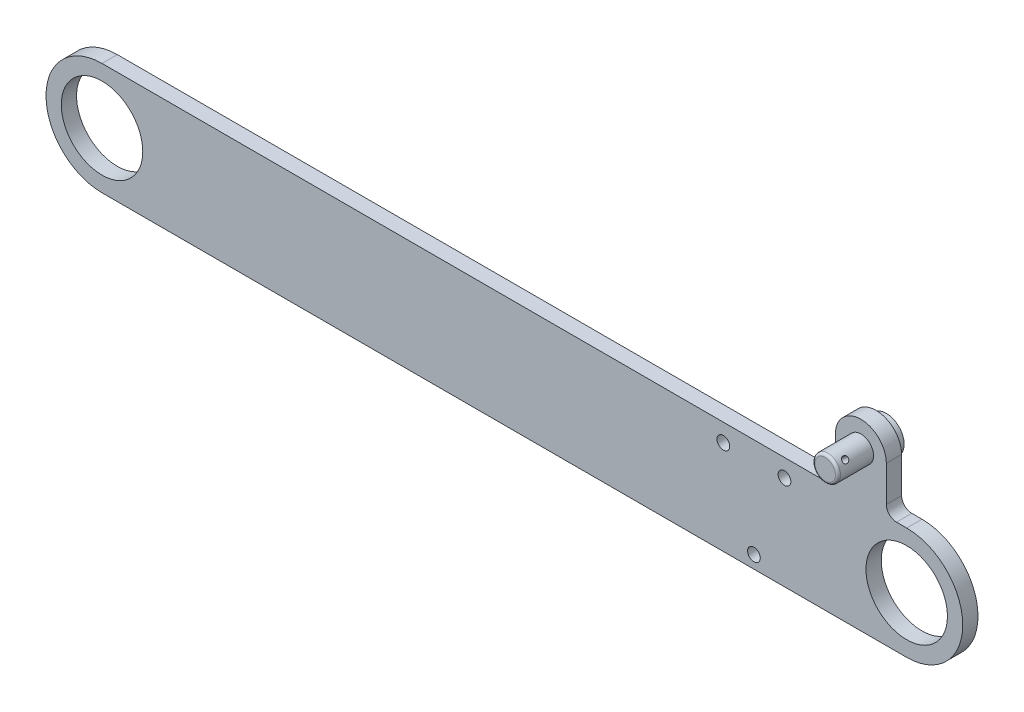
ISO-10303-21;
HEADER;
FILE_DESCRIPTION(('STEP AP214'),'2;1');
FILE_NAME('part.step','',(''),(''),'','','');
FILE_SCHEMA(('AUTOMOTIVE_DESIGN { 1 0 10303 214 1 1 1 1 }'));
ENDSEC;
DATA;
#1=APPLICATION_CONTEXT('core data for automotive mechanical design processes');
#2=APPLICATION_PROTOCOL_DEFINITION('international standard','automotive_design',2000,#1);
#3=PRODUCT_CONTEXT('',#1,'mechanical');
#4=PRODUCT('Part','Part','',(#3));
#5=PRODUCT_RELATED_PRODUCT_CATEGORY('part','',(#4));
#6=PRODUCT_DEFINITION_FORMATION('','',#4);
#7=PRODUCT_DEFINITION_CONTEXT('part definition',#1,'design');
#8=PRODUCT_DEFINITION('design','',#6,#7);
#9=PRODUCT_DEFINITION_SHAPE('','',#8);
#10=(LENGTH_UNIT() NAMED_UNIT(*) SI_UNIT(.MILLI.,.METRE.));
#11=(NAMED_UNIT(*) PLANE_ANGLE_UNIT() SI_UNIT($,.RADIAN.));
#12=(NAMED_UNIT(*) SI_UNIT($,.STERADIAN.) SOLID_ANGLE_UNIT());
#13=UNCERTAINTY_MEASURE_WITH_UNIT(LENGTH_MEASURE(1.E-05),#10,'distance_accuracy_value','');
#14=(GEOMETRIC_REPRESENTATION_CONTEXT(3) GLOBAL_UNCERTAINTY_ASSIGNED_CONTEXT((#13)) GLOBAL_UNIT_ASSIGNED_CONTEXT((#10,
#11,#12)) REPRESENTATION_CONTEXT('',''));
#15=CARTESIAN_POINT('',(0.,0.,0.));
#16=DIRECTION('',(0.,0.,1.));
#17=DIRECTION('',(1.,0.,0.));
#18=AXIS2_PLACEMENT_3D('',#15,#16,#17);
#19=CARTESIAN_POINT('',(70.,20.,10.));
#20=DIRECTION('',(0.,0.,-1.));
#21=DIRECTION('',(-1.,0.,0.));
#22=AXIS2_PLACEMENT_3D('',#19,#20,#21);
#23=CYLINDRICAL_SURFACE('',#22,2.5);
#24=CARTESIAN_POINT('',(67.7436349690487,18.9235164436462,8.));
#25=CARTESIAN_POINT('',(67.7436351072686,18.9235152441467,8.03317726278097));
#26=CARTESIAN_POINT('',(67.7448557709713,18.9209460651585,8.06636606034199));
#27=CARTESIAN_POINT('',(67.7497444382311,18.9107890215028,8.13179367052325));
#28=CARTESIAN_POINT('',(67.7534139801362,18.9031980022181,8.16403187269348));
#29=CARTESIAN_POINT('',(67.7632071781105,18.8833625557248,8.22660245908786));
#30=CARTESIAN_POINT('',(67.7693278260517,18.8711238333743,8.25693712684074));
#31=CARTESIAN_POINT('',(67.7840365533077,18.8425184392861,8.31493990872947));
#32=CARTESIAN_POINT('',(67.7926246863973,18.8261516775857,8.34260796473337));
#33=CARTESIAN_POINT('',(67.812451886865,18.7895982991643,8.39505376298856));
#34=CARTESIAN_POINT('',(67.8237365396877,18.7693473298744,8.41976943119803));
#35=CARTESIAN_POINT('',(67.8488356278632,18.7259833596058,8.46506307888667));
#36=CARTESIAN_POINT('',(67.8626502856391,18.7028701070499,8.48564069423846));
#37=CARTESIAN_POINT('',(67.892897512142,18.6542856670993,8.52232528654122));
#38=CARTESIAN_POINT('',(67.9093613100491,18.6287880980309,8.53837170470984));
#39=CARTESIAN_POINT('',(67.9445478747061,18.5765865330875,8.56514530746353));
#40=CARTESIAN_POINT('',(67.9632703345869,18.5498827014068,8.57587321362904));
#41=CARTESIAN_POINT('',(68.0022244423111,18.4966840409011,8.59150763087728));
#42=CARTESIAN_POINT('',(68.0224212428934,18.4701946698299,8.59651944284162));
#43=CARTESIAN_POINT('',(68.0641068938233,18.4177741646012,8.6009095039383));
#44=CARTESIAN_POINT('',(68.0855955671472,18.391842954618,8.6002885231848));
#45=CARTESIAN_POINT('',(68.1287690143684,18.3418188954358,8.59350725984298));
#46=CARTESIAN_POINT('',(68.1504407783505,18.3176992868261,8.58746058316626));
#47=CARTESIAN_POINT('',(68.1937090688285,18.2713243631664,8.57018165240741));
#48=CARTESIAN_POINT('',(68.2153055914474,18.2490691428612,8.55894913497941));
#49=CARTESIAN_POINT('',(68.2578696219065,18.2067092212648,8.53152263345041));
#50=CARTESIAN_POINT('',(68.2788302353838,18.1866243753037,8.51528734884629));
#51=CARTESIAN_POINT('',(68.3191769915788,18.1491642262131,8.47834731326672));
#52=CARTESIAN_POINT('',(68.3385628791007,18.1317893618378,8.45764183984532));
#53=CARTESIAN_POINT('',(68.3754822898228,18.0995900336202,8.41173691978306));
#54=CARTESIAN_POINT('',(68.3929574383316,18.0848401277696,8.38643812676618));
#55=CARTESIAN_POINT('',(68.4247385278427,18.0586146518571,8.3323848727683));
#56=CARTESIAN_POINT('',(68.4390443435343,18.0471392112575,8.30363027521937));
#57=CARTESIAN_POINT('',(68.4638733456753,18.0275479127243,8.24330694874735));
#58=CARTESIAN_POINT('',(68.4743805171909,18.0194462572494,8.21172698978464));
#59=CARTESIAN_POINT('',(68.4909848975434,18.0067655077387,8.14675337530469));
#60=CARTESIAN_POINT('',(68.4970829668994,18.0021857263319,8.11336007506358));
#61=CARTESIAN_POINT('',(68.5044433418075,17.9966699965873,8.04658132398784));
#62=CARTESIAN_POINT('',(68.5058200733367,17.9956478171908,8.0132155855003));
#63=CARTESIAN_POINT('',(68.5039832205544,17.9970184478186,7.94668336118663));
#64=CARTESIAN_POINT('',(68.5007700222887,17.9994109706421,7.91351685883893));
#65=CARTESIAN_POINT('',(68.4900094488248,18.0075210552478,7.84883081654652));
#66=CARTESIAN_POINT('',(68.4825269334701,18.0131888745706,7.81729416481627));
#67=CARTESIAN_POINT('',(68.4636514671684,18.0277489081317,7.75619843586694));
#68=CARTESIAN_POINT('',(68.4522580815351,18.0366414808019,7.72663957891284));
#69=CARTESIAN_POINT('',(68.4258464110042,18.0577512047007,7.66974424955912));
#70=CARTESIAN_POINT('',(68.4107658202929,18.0700260173282,7.64245812519877));
#71=CARTESIAN_POINT('',(68.3777502861589,18.0976938257087,7.59141985322126));
#72=CARTESIAN_POINT('',(68.3598149121161,18.1130872919802,7.56766823980293));
#73=CARTESIAN_POINT('',(68.3213742681353,18.1471941329003,7.52381699807816));
#74=CARTESIAN_POINT('',(68.3008196294859,18.1659753467029,7.50381324880208));
#75=CARTESIAN_POINT('',(68.258289115395,18.2063163724617,7.46871830738302));
#76=CARTESIAN_POINT('',(68.2363133122699,18.2278760430907,7.45362686551109));
#77=CARTESIAN_POINT('',(68.1919260629112,18.2731918193386,7.42891050454501));
#78=CARTESIAN_POINT('',(68.1695188172595,18.2969312443976,7.41924753589569));
#79=CARTESIAN_POINT('',(68.1249170067886,18.3461662937442,7.40554643592065));
#80=CARTESIAN_POINT('',(68.1027224050322,18.3716616064871,7.40150730944892));
#81=CARTESIAN_POINT('',(68.0598193074825,18.423043620354,7.39922082644262));
#82=CARTESIAN_POINT('',(68.0390875474552,18.4489046762744,7.40083144881171));
#83=CARTESIAN_POINT('',(67.9990925110755,18.5008522594096,7.40947599260352));
#84=CARTESIAN_POINT('',(67.9798291971687,18.5269387808392,7.41650977528173));
#85=CARTESIAN_POINT('',(67.9432924264001,18.5784001481508,7.4357273650232));
#86=CARTESIAN_POINT('',(67.9260102171163,18.6037777174903,7.44788731388833));
#87=CARTESIAN_POINT('',(67.8936200019659,18.6531385259882,7.4769900488296));
#88=CARTESIAN_POINT('',(67.8785122509079,18.6771216015402,7.49393339474873));
#89=CARTESIAN_POINT('',(67.8503259123814,18.7234213470768,7.53256509485597));
#90=CARTESIAN_POINT('',(67.8373002082941,18.7456888080868,7.55435101415086));
#91=CARTESIAN_POINT('',(67.8137726897564,18.7871603934015,7.60185752211585));
#92=CARTESIAN_POINT('',(67.8032715038989,18.8063637543606,7.62757908813937));
#93=CARTESIAN_POINT('',(67.7846598018713,18.8412651053313,7.68274787883908));
#94=CARTESIAN_POINT('',(67.7765924983688,18.8568986557056,7.71225052412954));
#95=CARTESIAN_POINT('',(67.7630867718195,18.8835573656554,7.77381236932969));
#96=CARTESIAN_POINT('',(67.7576463292594,18.8945860645248,7.80586958314216));
#97=CARTESIAN_POINT('',(67.7502147872679,18.9098064192906,7.8649185706977));
#98=CARTESIAN_POINT('',(67.7477471350327,18.9149325237176,7.89161416564011));
#99=CARTESIAN_POINT('',(67.744457227997,18.9217879068283,7.9455372748163));
#100=CARTESIAN_POINT('',(67.7436348555838,18.9235174283166,7.97276475088802));
#101=CARTESIAN_POINT('',(67.7436349690487,18.9235164436462,8.));
#102=B_SPLINE_CURVE_WITH_KNOTS('',3,(#24,#25,#26,#27,#28,#29,#30,#31,#32,#33,#34,#35,#36,#37,
#38,#39,#40,#41,#42,#43,#44,#45,#46,#47,#48,#49,#50,#51,#52,#53,#54,#55,#56,#57,#58,#59,#60,#61,
#62,#63,#64,#65,#66,#67,#68,#69,#70,#71,#72,#73,#74,#75,#76,#77,#78,#79,#80,#81,#82,#83,#84,#85,
#86,#87,#88,#89,#90,#91,#92,#93,#94,#95,#96,#97,#98,#99,#100,#101),.UNSPECIFIED.,.T.,.F.,(4,2,2,
2,2,2,2,2,2,2,2,2,2,2,2,2,2,2,2,2,2,2,2,2,2,2,2,2,2,2,2,2,2,2,2,2,2,2,4),(0.,0.0994318424270846,
0.19892620528684,0.298298835729565,0.397673631998774,0.498864836367138,0.600064941148508,
0.702559661511638,0.80504047226266,0.905601256951163,1.00614829319889,1.10463792303746,
1.20313255489792,1.30246314382185,1.40180979801179,1.50363833691343,1.60547090124191,
1.70772791443204,1.80996496485345,1.90970599196144,2.0094386306341,2.10769499645013,
2.20596228682608,2.30602130518178,2.40609543092975,2.50845688243904,2.61081312934523,
2.71244268581557,2.81405425652064,2.91313005864325,3.01220332612423,3.11082049082985,
3.20944920235745,3.31028171538914,3.41113930928652,3.51369445584713,3.61617063265693,
3.69780016978634,3.77942387141728),.UNSPECIFIED.);
#103=CARTESIAN_POINT('',(67.7436349690487,18.9235164436462,8.));
#104=VERTEX_POINT('',#103);
#105=EDGE_CURVE('E47',#104,#104,#102,.T.);
#106=ORIENTED_EDGE('',*,*,#105,.T.);
#107=EDGE_LOOP('',(#106));
#108=FACE_BOUND('',#107,.T.);
#109=CARTESIAN_POINT('',(71.4948216749806,22.0038732894093,8.));
#110=CARTESIAN_POINT('',(71.4948228246828,22.0038729205073,7.96682273721903));
#111=CARTESIAN_POINT('',(71.4971054915764,22.0021758252237,7.93363393965801));
#112=CARTESIAN_POINT('',(71.50611760316,21.9954048246915,7.86820632947675));
#113=CARTESIAN_POINT('',(71.5128498429781,21.9903287968542,7.83596812730651));
#114=CARTESIAN_POINT('',(71.5304014820059,21.9768643387668,7.77339754091214));
#115=CARTESIAN_POINT('',(71.5412158704543,21.9684799688751,7.74306287315925));
#116=CARTESIAN_POINT('',(71.5664137944226,21.9484879740742,7.68506009127052));
#117=CARTESIAN_POINT('',(71.5807974077268,21.9368802789181,7.65739203526663));
#118=CARTESIAN_POINT('',(71.6127958775578,21.9103215650772,7.60494623701144));
#119=CARTESIAN_POINT('',(71.630464990363,21.8953133140402,7.58023056880197));
#120=CARTESIAN_POINT('',(71.6681184969573,21.862258638337,7.53493692111333));
#121=CARTESIAN_POINT('',(71.6881030942534,21.8442119465601,7.51435930576153));
#122=CARTESIAN_POINT('',(71.7298759591748,21.8050919993121,7.47767471345878));
#123=CARTESIAN_POINT('',(71.7516840299813,21.7839829794954,7.46162829529015));
#124=CARTESIAN_POINT('',(71.7960441485924,21.7393144492788,7.43485469253647));
#125=CARTESIAN_POINT('',(71.8185960950298,21.715755271825,7.42412678637096));
#126=CARTESIAN_POINT('',(71.8632014155331,21.6671972099712,7.40849236912272));
#127=CARTESIAN_POINT('',(71.8852562144515,21.642233568847,7.40348055715838));
#128=CARTESIAN_POINT('',(71.9285669133898,21.591147502064,7.39909049606169));
#129=CARTESIAN_POINT('',(71.949822922221,21.5650252352982,7.39971147681519));
#130=CARTESIAN_POINT('',(71.9904935483404,21.5129459379424,7.40649274015702));
#131=CARTESIAN_POINT('',(72.0099369445561,21.4869964636281,7.41253941683374));
#132=CARTESIAN_POINT('',(72.0470096876715,21.4355339508326,7.42981834759259));
#133=CARTESIAN_POINT('',(72.0646389423904,21.4100209345838,7.44105086502059));
#134=CARTESIAN_POINT('',(72.0979103628627,21.3600302131814,7.46847736654958));
#135=CARTESIAN_POINT('',(72.1135343936026,21.3355631328883,7.4847126511537));
#136=CARTESIAN_POINT('',(72.1424309266246,21.288700419729,7.52165268673327));
#137=CARTESIAN_POINT('',(72.1557030481728,21.2663051225289,7.54235816015468));
#138=CARTESIAN_POINT('',(72.1801059201995,21.2238276053865,7.58826308021694));
#139=CARTESIAN_POINT('',(72.1911748916242,21.2038171478803,7.61356187323381));
#140=CARTESIAN_POINT('',(72.210717503254,21.1675418178607,7.66761512723169));
#141=CARTESIAN_POINT('',(72.2191910408445,21.1512770934469,7.69636972478063));
#142=CARTESIAN_POINT('',(72.2335784867147,21.1231115164624,7.75669305125265));
#143=CARTESIAN_POINT('',(72.2394815789778,21.1112291355383,7.78827301021535));
#144=CARTESIAN_POINT('',(72.2486902949924,21.09247529848,7.8532466246953));
#145=CARTESIAN_POINT('',(72.2519964256006,21.0856028645585,7.88663992493642));
#146=CARTESIAN_POINT('',(72.2559750882979,21.0773101788328,7.95341867601215));
#147=CARTESIAN_POINT('',(72.2567099466565,21.0757609133247,7.98678441449969));
#148=CARTESIAN_POINT('',(72.2557227938036,21.0778292908788,8.05331663881336));
#149=CARTESIAN_POINT('',(72.2540009892151,21.081446499404,8.08648314116107));
#150=CARTESIAN_POINT('',(72.2481389196261,21.0935790817226,8.15116918345347));
#151=CARTESIAN_POINT('',(72.244034830674,21.1020211588238,8.18270583518373));
#152=CARTESIAN_POINT('',(72.2334244894424,21.1233682538101,8.24380156413306));
#153=CARTESIAN_POINT('',(72.2269179701309,21.1362737677996,8.27336042108716));
#154=CARTESIAN_POINT('',(72.2113489566535,21.1662871415296,8.33025575044087));
#155=CARTESIAN_POINT('',(72.2022420219571,21.1834673330791,8.35754187480122));
#156=CARTESIAN_POINT('',(72.1815247469999,21.2212340860913,8.40858014677874));
#157=CARTESIAN_POINT('',(72.1699140289704,21.2418211614724,8.43233176019707));
#158=CARTESIAN_POINT('',(72.1439359837108,21.2861618975026,8.47618300192184));
#159=CARTESIAN_POINT('',(72.1295117161204,21.309977179705,8.49618675119792));
#160=CARTESIAN_POINT('',(72.098214109665,21.3595423168306,8.53128169261698));
#161=CARTESIAN_POINT('',(72.0813408953611,21.385292073328,8.54637313448891));
#162=CARTESIAN_POINT('',(72.0455247249028,21.4376461506887,8.57108949545498));
#163=CARTESIAN_POINT('',(72.0265973136163,21.4642431065637,8.5807524641043));
#164=CARTESIAN_POINT('',(71.9869784665817,21.5175700091655,8.59445356407935));
#165=CARTESIAN_POINT('',(71.9662873436127,21.5442999315235,8.59849269055108));
#166=CARTESIAN_POINT('',(71.9242321132949,21.596378187363,8.60077917355738));
#167=CARTESIAN_POINT('',(71.9028976865803,21.6217443523059,8.59916855118828));
#168=CARTESIAN_POINT('',(71.859722024546,21.6710801054318,8.59052400739647));
#169=CARTESIAN_POINT('',(71.8378808022059,21.6950497293267,8.58349022471827));
#170=CARTESIAN_POINT('',(71.7945093799886,21.740898695276,8.5642726349768));
#171=CARTESIAN_POINT('',(71.7729782111623,21.7627871523318,8.55211268611166));
#172=CARTESIAN_POINT('',(71.7308606530493,21.8041601719418,8.5230099511704));
#173=CARTESIAN_POINT('',(71.7102743746795,21.8236444527303,8.50606660525127));
#174=CARTESIAN_POINT('',(71.6703416886398,21.8602984661796,8.46743490514403));
#175=CARTESIAN_POINT('',(71.6510332633399,21.8774067536228,8.44564898584914));
#176=CARTESIAN_POINT('',(71.6149302999357,21.908551778113,8.39814247788415));
#177=CARTESIAN_POINT('',(71.5981363883251,21.9225877500904,8.37242091186063));
#178=CARTESIAN_POINT('',(71.5675219568223,21.9476328361495,8.31725212116091));
#179=CARTESIAN_POINT('',(71.5537562401576,21.9585870283979,8.28774947587045));
#180=CARTESIAN_POINT('',(71.5302338140662,21.977020338914,8.22618763067031));
#181=CARTESIAN_POINT('',(71.5204740257766,21.9845021265711,8.19413041685784));
#182=CARTESIAN_POINT('',(71.5069899464314,21.994752327534,8.1350814293023));
#183=CARTESIAN_POINT('',(71.50244175275,21.9981699565934,8.10838583435989));
#184=CARTESIAN_POINT('',(71.4963572527734,22.0027305076492,8.0544627251837));
#185=CARTESIAN_POINT('',(71.4948207311889,22.0038735922414,8.02723524911198));
#186=CARTESIAN_POINT('',(71.4948216749806,22.0038732894093,8.));
#187=B_SPLINE_CURVE_WITH_KNOTS('',3,(#109,#110,#111,#112,#113,#114,#115,#116,#117,#118,#119,
#120,#121,#122,#123,#124,#125,#126,#127,#128,#129,#130,#131,#132,#133,#134,#135,#136,#137,#138,
#139,#140,#141,#142,#143,#144,#145,#146,#147,#148,#149,#150,#151,#152,#153,#154,#155,#156,#157,
#158,#159,#160,#161,#162,#163,#164,#165,#166,#167,#168,#169,#170,#171,#172,#173,#174,#175,#176,
#177,#178,#179,#180,#181,#182,#183,#184,#185,#186),.UNSPECIFIED.,.T.,.F.,(4,2,2,2,2,2,2,2,2,2,2,
2,2,2,2,2,2,2,2,2,2,2,2,2,2,2,2,2,2,2,2,2,2,2,2,2,2,2,4),(0.,0.0994318424270851,
0.198926205286841,0.298298835729571,0.397673631998777,0.49886483636713,0.600064941148516,
0.702559661511642,0.805040472262653,0.905601256951171,1.00614829319891,1.10463792303747,
1.20313255489791,1.30246314382184,1.40180979801179,1.50363833691342,1.60547090124191,
1.70772791443204,1.80996496485345,1.90970599196143,2.0094386306341,2.10769499645014,
2.20596228682608,2.30602130518178,2.40609543092975,2.50845688243904,2.61081312934524,
2.71244268581555,2.81405425652064,2.91313005864323,3.01220332612422,3.11082049082984,
3.20944920235745,3.31028171538913,3.41113930928653,3.51369445584714,3.61617063265692,
3.69780016978634,3.77942387141728),.UNSPECIFIED.);
#188=CARTESIAN_POINT('',(71.4948216749806,22.0038732894093,8.));
#189=VERTEX_POINT('',#188);
#190=EDGE_CURVE('E11',#189,#189,#187,.T.);
#191=ORIENTED_EDGE('',*,*,#190,.T.);
#192=EDGE_LOOP('',(#191));
#193=FACE_BOUND('',#192,.T.);
#194=CARTESIAN_POINT('',(70.,20.,9.5));
#195=DIRECTION('',(0.,0.,1.));
#196=DIRECTION('',(1.,0.,0.));
#197=AXIS2_PLACEMENT_3D('',#194,#195,#196);
#198=CIRCLE('',#197,2.5);
#199=CARTESIAN_POINT('',(72.5,20.,9.5));
#200=VERTEX_POINT('',#199);
#201=EDGE_CURVE('E54',#200,#200,#198,.F.);
#202=ORIENTED_EDGE('',*,*,#201,.T.);
#203=EDGE_LOOP('',(#202));
#204=FACE_BOUND('',#203,.T.);
#205=CARTESIAN_POINT('',(70.,20.,0.));
#206=DIRECTION('',(0.,0.,1.));
#207=DIRECTION('',(1.,0.,0.));
#208=AXIS2_PLACEMENT_3D('',#205,#206,#207);
#209=CIRCLE('',#208,2.5);
#210=CARTESIAN_POINT('',(72.5,20.,0.));
#211=VERTEX_POINT('',#210);
#212=EDGE_CURVE('E92',#211,#211,#209,.T.);
#213=ORIENTED_EDGE('',*,*,#212,.T.);
#214=EDGE_LOOP('',(#213));
#215=FACE_BOUND('',#214,.T.);
#216=ADVANCED_FACE('F43',(#108,#193,#204,#215),#23,.T.);
#217=CARTESIAN_POINT('',(70.,20.,10.));
#218=DIRECTION('',(0.,0.,1.));
#219=DIRECTION('',(1.,0.,0.));
#220=AXIS2_PLACEMENT_3D('',#217,#218,#219);
#221=PLANE('',#220);
#222=CARTESIAN_POINT('',(70.,20.,10.));
#223=DIRECTION('',(0.,0.,1.));
#224=DIRECTION('',(1.,0.,0.));
#225=AXIS2_PLACEMENT_3D('',#222,#223,#224);
#226=CIRCLE('',#225,2.);
#227=CARTESIAN_POINT('',(72.,20.,10.));
#228=VERTEX_POINT('',#227);
#229=EDGE_CURVE('E58',#228,#228,#226,.T.);
#230=ORIENTED_EDGE('',*,*,#229,.T.);
#231=EDGE_LOOP('',(#230));
#232=FACE_BOUND('',#231,.T.);
#233=ADVANCED_FACE('F70',(#232),#221,.T.);
#234=CARTESIAN_POINT('',(70.,20.,0.));
#235=DIRECTION('',(0.,0.,1.));
#236=DIRECTION('',(1.,0.,0.));
#237=AXIS2_PLACEMENT_3D('',#234,#235,#236);
#238=PLANE('',#237);
#239=ORIENTED_EDGE('',*,*,#212,.F.);
#240=EDGE_LOOP('',(#239));
#241=FACE_BOUND('',#240,.T.);
#242=ADVANCED_FACE('F73',(#241),#238,.F.);
#243=CARTESIAN_POINT('',(70.,20.,9.5));
#244=DIRECTION('',(0.,0.,1.));
#245=DIRECTION('',(1.,0.,0.));
#246=AXIS2_PLACEMENT_3D('',#243,#244,#245);
#247=TOROIDAL_SURFACE('',#246,2.,0.5);
#248=ORIENTED_EDGE('',*,*,#201,.F.);
#249=EDGE_LOOP('',(#248));
#250=FACE_BOUND('',#249,.T.);
#251=ORIENTED_EDGE('',*,*,#229,.F.);
#252=EDGE_LOOP('',(#251));
#253=FACE_BOUND('',#252,.T.);
#254=ADVANCED_FACE('F45',(#250,#253),#247,.T.);
#255=CARTESIAN_POINT('',(71.9320619438657,21.5865486582723,8.));
#256=DIRECTION('',(0.772824777546306,0.63461946330892,0.));
#257=DIRECTION('',(-0.63461946330892,0.772824777546306,0.));
#258=AXIS2_PLACEMENT_3D('',#255,#256,#257);
#259=CYLINDRICAL_SURFACE('',#258,0.599999999999976);
#260=ORIENTED_EDGE('',*,*,#190,.F.);
#261=EDGE_LOOP('',(#260));
#262=FACE_BOUND('',#261,.T.);
#263=ORIENTED_EDGE('',*,*,#105,.F.);
#264=EDGE_LOOP('',(#263));
#265=FACE_BOUND('',#264,.T.);
#266=ADVANCED_FACE('F65',(#262,#265),#259,.F.);
#267=CLOSED_SHELL('',(#216,#233,#242,#254,#266));
#268=MANIFOLD_SOLID_BREP('B2',#267);
#269=CARTESIAN_POINT('',(70.,20.,-2.));
#270=DIRECTION('',(0.,0.,1.));
#271=DIRECTION('',(1.,0.,0.));
#272=AXIS2_PLACEMENT_3D('',#269,#270,#271);
#273=CYLINDRICAL_SURFACE('',#272,3.50000000000001);
#274=CARTESIAN_POINT('',(70.,20.,-2.));
#275=DIRECTION('',(0.,0.,-1.));
#276=DIRECTION('',(-1.,0.,0.));
#277=AXIS2_PLACEMENT_3D('',#274,#275,#276);
#278=CIRCLE('',#277,3.50000000000001);
#279=CARTESIAN_POINT('',(66.5,20.,-2.));
#280=VERTEX_POINT('',#279);
#281=EDGE_CURVE('E42',#280,#280,#278,.T.);
#282=ORIENTED_EDGE('',*,*,#281,.F.);
#283=EDGE_LOOP('',(#282));
#284=FACE_BOUND('',#283,.T.);
#285=CARTESIAN_POINT('',(70.,20.,0.));
#286=DIRECTION('',(0.,0.,-1.));
#287=DIRECTION('',(-1.,0.,0.));
#288=AXIS2_PLACEMENT_3D('',#285,#286,#287);
#289=CIRCLE('',#288,3.50000000000001);
#290=CARTESIAN_POINT('',(66.5,20.,0.));
#291=VERTEX_POINT('',#290);
#292=EDGE_CURVE('E139',#291,#291,#289,.T.);
#293=ORIENTED_EDGE('',*,*,#292,.T.);
#294=EDGE_LOOP('',(#293));
#295=FACE_BOUND('',#294,.T.);
#296=ADVANCED_FACE('F136',(#284,#295),#273,.T.);
#297=CARTESIAN_POINT('',(70.,20.,-2.));
#298=DIRECTION('',(0.,0.,-1.));
#299=DIRECTION('',(-1.,0.,0.));
#300=AXIS2_PLACEMENT_3D('',#297,#298,#299);
#301=PLANE('',#300);
#302=ORIENTED_EDGE('',*,*,#281,.T.);
#303=EDGE_LOOP('',(#302));
#304=FACE_BOUND('',#303,.T.);
#305=ADVANCED_FACE('F151',(#304),#301,.T.);
#306=CARTESIAN_POINT('',(70.,20.,0.));
#307=DIRECTION('',(0.,0.,-1.));
#308=DIRECTION('',(-1.,0.,0.));
#309=AXIS2_PLACEMENT_3D('',#306,#307,#308);
#310=PLANE('',#309);
#311=ORIENTED_EDGE('',*,*,#292,.F.);
#312=EDGE_LOOP('',(#311));
#313=FACE_BOUND('',#312,.T.);
#314=ADVANCED_FACE('F149',(#313),#310,.F.);
#315=CLOSED_SHELL('',(#296,#305,#314));
#316=MANIFOLD_SOLID_BREP('B6',#315);
#317=CARTESIAN_POINT('',(79.,11.,3.));
#318=DIRECTION('',(0.,-1.,0.));
#319=DIRECTION('',(1.,0.,0.));
#320=AXIS2_PLACEMENT_3D('',#317,#318,#319);
#321=PLANE('',#320);
#322=DIRECTION('',(-1.,0.,0.));
#323=VECTOR('',#322,1.);
#324=CARTESIAN_POINT('',(79.,11.,0.));
#325=LINE('',#324,#323);
#326=CARTESIAN_POINT('',(79.,11.,0.));
#327=VERTEX_POINT('',#326);
#328=CARTESIAN_POINT('',(77.,11.,0.));
#329=VERTEX_POINT('',#328);
#330=EDGE_CURVE('E298',#327,#329,#325,.T.);
#331=ORIENTED_EDGE('',*,*,#330,.T.);
#332=DIRECTION('',(0.,0.,1.));
#333=VECTOR('',#332,1.);
#334=CARTESIAN_POINT('',(77.,11.,3.));
#335=LINE('',#334,#333);
#336=CARTESIAN_POINT('',(77.,11.,3.));
#337=VERTEX_POINT('',#336);
#338=EDGE_CURVE('E331',#329,#337,#335,.T.);
#339=ORIENTED_EDGE('',*,*,#338,.T.);
#340=DIRECTION('',(-1.,0.,0.));
#341=VECTOR('',#340,1.);
#342=CARTESIAN_POINT('',(79.,11.,3.));
#343=LINE('',#342,#341);
#344=CARTESIAN_POINT('',(79.,11.,3.));
#345=VERTEX_POINT('',#344);
#346=EDGE_CURVE('E303',#345,#337,#343,.T.);
#347=ORIENTED_EDGE('',*,*,#346,.F.);
#348=DIRECTION('',(0.,0.,-1.));
#349=VECTOR('',#348,1.);
#350=CARTESIAN_POINT('',(79.,11.,3.));
#351=LINE('',#350,#349);
#352=EDGE_CURVE('E317',#345,#327,#351,.T.);
#353=ORIENTED_EDGE('',*,*,#352,.T.);
#354=EDGE_LOOP('',(#331,#339,#347,#353));
#355=FACE_BOUND('',#354,.T.);
#356=ADVANCED_FACE('F177',(#355),#321,.F.);
#357=CARTESIAN_POINT('',(-79.,0.,3.));
#358=DIRECTION('',(0.,0.,1.));
#359=DIRECTION('',(1.,0.,0.));
#360=AXIS2_PLACEMENT_3D('',#357,#358,#359);
#361=PLANE('',#360);
#362=CARTESIAN_POINT('',(49.0000000000005,-8.50000000000056,3.));
#363=DIRECTION('',(0.,0.,1.));
#364=DIRECTION('',(1.,0.,0.));
#365=AXIS2_PLACEMENT_3D('',#362,#363,#364);
#366=CIRCLE('',#365,1.25);
#367=CARTESIAN_POINT('',(50.2500000000005,-8.50000000000056,3.));
#368=VERTEX_POINT('',#367);
#369=EDGE_CURVE('E397',#368,#368,#366,.T.);
#370=ORIENTED_EDGE('',*,*,#369,.F.);
#371=EDGE_LOOP('',(#370));
#372=FACE_BOUND('',#371,.T.);
#373=CARTESIAN_POINT('',(43.0000000000006,7.49999999999945,3.));
#374=DIRECTION('',(0.,0.,1.));
#375=DIRECTION('',(1.,0.,0.));
#376=AXIS2_PLACEMENT_3D('',#373,#374,#375);
#377=CIRCLE('',#376,1.25);
#378=CARTESIAN_POINT('',(44.2500000000006,7.49999999999945,3.));
#379=VERTEX_POINT('',#378);
#380=EDGE_CURVE('E388',#379,#379,#377,.T.);
#381=ORIENTED_EDGE('',*,*,#380,.F.);
#382=EDGE_LOOP('',(#381));
#383=FACE_BOUND('',#382,.T.);
#384=CARTESIAN_POINT('',(55.0000000000005,7.49999999999944,3.));
#385=DIRECTION('',(0.,0.,1.));
#386=DIRECTION('',(1.,0.,0.));
#387=AXIS2_PLACEMENT_3D('',#384,#385,#386);
#388=CIRCLE('',#387,1.25);
#389=CARTESIAN_POINT('',(56.2500000000005,7.49999999999944,3.));
#390=VERTEX_POINT('',#389);
#391=EDGE_CURVE('E378',#390,#390,#388,.T.);
#392=ORIENTED_EDGE('',*,*,#391,.F.);
#393=EDGE_LOOP('',(#392));
#394=FACE_BOUND('',#393,.T.);
#395=CARTESIAN_POINT('',(-79.,0.,3.));
#396=DIRECTION('',(0.,0.,1.));
#397=DIRECTION('',(1.,0.,0.));
#398=AXIS2_PLACEMENT_3D('',#395,#396,#397);
#399=CIRCLE('',#398,8.00000000000001);
#400=CARTESIAN_POINT('',(-71.,0.,3.));
#401=VERTEX_POINT('',#400);
#402=EDGE_CURVE('E289',#401,#401,#399,.T.);
#403=ORIENTED_EDGE('',*,*,#402,.F.);
#404=EDGE_LOOP('',(#403));
#405=FACE_BOUND('',#404,.T.);
#406=CARTESIAN_POINT('',(-79.,0.,3.));
#407=DIRECTION('',(0.,0.,1.));
#408=DIRECTION('',(1.,0.,0.));
#409=AXIS2_PLACEMENT_3D('',#406,#407,#408);
#410=CIRCLE('',#409,11.);
#411=CARTESIAN_POINT('',(-79.,11.,3.));
#412=VERTEX_POINT('',#411);
#413=CARTESIAN_POINT('',(-79.,-11.,3.));
#414=VERTEX_POINT('',#413);
#415=EDGE_CURVE('E295',#412,#414,#410,.T.);
#416=ORIENTED_EDGE('',*,*,#415,.T.);
#417=DIRECTION('',(1.,0.,0.));
#418=VECTOR('',#417,1.);
#419=CARTESIAN_POINT('',(79.,-11.,3.));
#420=LINE('',#419,#418);
#421=CARTESIAN_POINT('',(79.,-11.,3.));
#422=VERTEX_POINT('',#421);
#423=EDGE_CURVE('E297',#414,#422,#420,.T.);
#424=ORIENTED_EDGE('',*,*,#423,.T.);
#425=CARTESIAN_POINT('',(79.,0.,3.));
#426=DIRECTION('',(0.,0.,1.));
#427=DIRECTION('',(1.,0.,0.));
#428=AXIS2_PLACEMENT_3D('',#425,#426,#427);
#429=CIRCLE('',#428,11.);
#430=EDGE_CURVE('E300',#422,#345,#429,.T.);
#431=ORIENTED_EDGE('',*,*,#430,.T.);
#432=ORIENTED_EDGE('',*,*,#346,.T.);
#433=CARTESIAN_POINT('',(77.,13.,3.));
#434=DIRECTION('',(0.,0.,1.));
#435=DIRECTION('',(1.,0.,0.));
#436=AXIS2_PLACEMENT_3D('',#433,#434,#435);
#437=CIRCLE('',#436,2.);
#438=CARTESIAN_POINT('',(75.,13.,3.));
#439=VERTEX_POINT('',#438);
#440=EDGE_CURVE('E185',#337,#439,#437,.F.);
#441=ORIENTED_EDGE('',*,*,#440,.T.);
#442=DIRECTION('',(0.,1.,0.));
#443=VECTOR('',#442,1.);
#444=CARTESIAN_POINT('',(75.,11.,3.));
#445=LINE('',#444,#443);
#446=CARTESIAN_POINT('',(75.,20.,3.));
#447=VERTEX_POINT('',#446);
#448=EDGE_CURVE('E251',#439,#447,#445,.T.);
#449=ORIENTED_EDGE('',*,*,#448,.T.);
#450=CARTESIAN_POINT('',(70.,20.,3.));
#451=DIRECTION('',(0.,0.,1.));
#452=DIRECTION('',(1.,0.,0.));
#453=AXIS2_PLACEMENT_3D('',#450,#451,#452);
#454=CIRCLE('',#453,5.);
#455=CARTESIAN_POINT('',(65.,20.,3.));
#456=VERTEX_POINT('',#455);
#457=EDGE_CURVE('E258',#447,#456,#454,.T.);
#458=ORIENTED_EDGE('',*,*,#457,.T.);
#459=DIRECTION('',(0.,-1.,0.));
#460=VECTOR('',#459,1.);
#461=CARTESIAN_POINT('',(65.,20.,3.));
#462=LINE('',#461,#460);
#463=CARTESIAN_POINT('',(65.,13.,3.));
#464=VERTEX_POINT('',#463);
#465=EDGE_CURVE('E269',#456,#464,#462,.T.);
#466=ORIENTED_EDGE('',*,*,#465,.T.);
#467=CARTESIAN_POINT('',(63.,13.,3.));
#468=DIRECTION('',(0.,0.,1.));
#469=DIRECTION('',(1.,0.,0.));
#470=AXIS2_PLACEMENT_3D('',#467,#468,#469);
#471=CIRCLE('',#470,2.);
#472=CARTESIAN_POINT('',(63.,11.,3.));
#473=VERTEX_POINT('',#472);
#474=EDGE_CURVE('E335',#464,#473,#471,.F.);
#475=ORIENTED_EDGE('',*,*,#474,.T.);
#476=EDGE_CURVE('E302',#473,#412,#343,.T.);
#477=ORIENTED_EDGE('',*,*,#476,.T.);
#478=EDGE_LOOP('',(#416,#424,#431,#432,#441,#449,#458,#466,#475,#477));
#479=FACE_BOUND('',#478,.T.);
#480=CARTESIAN_POINT('',(79.,0.,3.));
#481=DIRECTION('',(0.,0.,1.));
#482=DIRECTION('',(1.,0.,0.));
#483=AXIS2_PLACEMENT_3D('',#480,#481,#482);
#484=CIRCLE('',#483,8.00000000000001);
#485=CARTESIAN_POINT('',(87.,0.,3.));
#486=VERTEX_POINT('',#485);
#487=EDGE_CURVE('E283',#486,#486,#484,.T.);
#488=ORIENTED_EDGE('',*,*,#487,.F.);
#489=EDGE_LOOP('',(#488));
#490=FACE_BOUND('',#489,.T.);
#491=CARTESIAN_POINT('',(70.,20.,3.));
#492=DIRECTION('',(0.,0.,1.));
#493=DIRECTION('',(1.,0.,0.));
#494=AXIS2_PLACEMENT_3D('',#491,#492,#493);
#495=CIRCLE('',#494,2.5);
#496=CARTESIAN_POINT('',(72.5,20.,3.));
#497=VERTEX_POINT('',#496);
#498=EDGE_CURVE('E260',#497,#497,#495,.T.);
#499=ORIENTED_EDGE('',*,*,#498,.F.);
#500=EDGE_LOOP('',(#499));
#501=FACE_BOUND('',#500,.T.);
#502=ADVANCED_FACE('F254',(#372,#383,#394,#405,#479,#490,#501),#361,.T.);
#503=CARTESIAN_POINT('',(-79.,0.,0.));
#504=DIRECTION('',(0.,0.,1.));
#505=DIRECTION('',(1.,0.,0.));
#506=AXIS2_PLACEMENT_3D('',#503,#504,#505);
#507=PLANE('',#506);
#508=CARTESIAN_POINT('',(49.0000000000005,-8.50000000000056,0.));
#509=DIRECTION('',(0.,0.,-1.));
#510=DIRECTION('',(-1.,0.,0.));
#511=AXIS2_PLACEMENT_3D('',#508,#509,#510);
#512=CIRCLE('',#511,1.25);
#513=CARTESIAN_POINT('',(47.7500000000005,-8.50000000000056,0.));
#514=VERTEX_POINT('',#513);
#515=EDGE_CURVE('E400',#514,#514,#512,.T.);
#516=ORIENTED_EDGE('',*,*,#515,.F.);
#517=EDGE_LOOP('',(#516));
#518=FACE_BOUND('',#517,.T.);
#519=CARTESIAN_POINT('',(43.0000000000006,7.49999999999945,0.));
#520=DIRECTION('',(0.,0.,-1.));
#521=DIRECTION('',(-1.,0.,0.));
#522=AXIS2_PLACEMENT_3D('',#519,#520,#521);
#523=CIRCLE('',#522,1.25);
#524=CARTESIAN_POINT('',(41.7500000000006,7.49999999999945,0.));
#525=VERTEX_POINT('',#524);
#526=EDGE_CURVE('E392',#525,#525,#523,.T.);
#527=ORIENTED_EDGE('',*,*,#526,.F.);
#528=EDGE_LOOP('',(#527));
#529=FACE_BOUND('',#528,.T.);
#530=CARTESIAN_POINT('',(55.0000000000005,7.49999999999944,0.));
#531=DIRECTION('',(0.,0.,-1.));
#532=DIRECTION('',(-1.,0.,0.));
#533=AXIS2_PLACEMENT_3D('',#530,#531,#532);
#534=CIRCLE('',#533,1.25);
#535=CARTESIAN_POINT('',(53.7500000000005,7.49999999999944,0.));
#536=VERTEX_POINT('',#535);
#537=EDGE_CURVE('E384',#536,#536,#534,.T.);
#538=ORIENTED_EDGE('',*,*,#537,.F.);
#539=EDGE_LOOP('',(#538));
#540=FACE_BOUND('',#539,.T.);
#541=CARTESIAN_POINT('',(-79.,0.,0.));
#542=DIRECTION('',(0.,0.,1.));
#543=DIRECTION('',(1.,0.,0.));
#544=AXIS2_PLACEMENT_3D('',#541,#542,#543);
#545=CIRCLE('',#544,11.);
#546=CARTESIAN_POINT('',(-79.,11.,0.));
#547=VERTEX_POINT('',#546);
#548=CARTESIAN_POINT('',(-79.,-11.,0.));
#549=VERTEX_POINT('',#548);
#550=EDGE_CURVE('E292',#547,#549,#545,.T.);
#551=ORIENTED_EDGE('',*,*,#550,.F.);
#552=CARTESIAN_POINT('',(63.,11.,0.));
#553=VERTEX_POINT('',#552);
#554=EDGE_CURVE('E312',#553,#547,#325,.T.);
#555=ORIENTED_EDGE('',*,*,#554,.F.);
#556=CARTESIAN_POINT('',(63.,13.,0.));
#557=DIRECTION('',(0.,0.,1.));
#558=DIRECTION('',(1.,0.,0.));
#559=AXIS2_PLACEMENT_3D('',#556,#557,#558);
#560=CIRCLE('',#559,2.);
#561=CARTESIAN_POINT('',(65.,13.,0.));
#562=VERTEX_POINT('',#561);
#563=EDGE_CURVE('E337',#553,#562,#560,.T.);
#564=ORIENTED_EDGE('',*,*,#563,.T.);
#565=DIRECTION('',(0.,1.,0.));
#566=VECTOR('',#565,1.);
#567=CARTESIAN_POINT('',(65.,20.,0.));
#568=LINE('',#567,#566);
#569=CARTESIAN_POINT('',(65.,20.,0.));
#570=VERTEX_POINT('',#569);
#571=EDGE_CURVE('E345',#562,#570,#568,.T.);
#572=ORIENTED_EDGE('',*,*,#571,.T.);
#573=CARTESIAN_POINT('',(70.,20.,0.));
#574=DIRECTION('',(0.,0.,1.));
#575=DIRECTION('',(1.,0.,0.));
#576=AXIS2_PLACEMENT_3D('',#573,#574,#575);
#577=CIRCLE('',#576,5.);
#578=CARTESIAN_POINT('',(75.,20.,0.));
#579=VERTEX_POINT('',#578);
#580=EDGE_CURVE('E277',#570,#579,#577,.F.);
#581=ORIENTED_EDGE('',*,*,#580,.T.);
#582=DIRECTION('',(0.,-1.,0.));
#583=VECTOR('',#582,1.);
#584=CARTESIAN_POINT('',(75.,11.,0.));
#585=LINE('',#584,#583);
#586=CARTESIAN_POINT('',(75.,13.,0.));
#587=VERTEX_POINT('',#586);
#588=EDGE_CURVE('E265',#579,#587,#585,.T.);
#589=ORIENTED_EDGE('',*,*,#588,.T.);
#590=CARTESIAN_POINT('',(77.,13.,0.));
#591=DIRECTION('',(0.,0.,1.));
#592=DIRECTION('',(1.,0.,0.));
#593=AXIS2_PLACEMENT_3D('',#590,#591,#592);
#594=CIRCLE('',#593,2.);
#595=EDGE_CURVE('E134',#587,#329,#594,.T.);
#596=ORIENTED_EDGE('',*,*,#595,.T.);
#597=ORIENTED_EDGE('',*,*,#330,.F.);
#598=CARTESIAN_POINT('',(79.,0.,0.));
#599=DIRECTION('',(0.,0.,1.));
#600=DIRECTION('',(1.,0.,0.));
#601=AXIS2_PLACEMENT_3D('',#598,#599,#600);
#602=CIRCLE('',#601,11.);
#603=CARTESIAN_POINT('',(79.,-11.,0.));
#604=VERTEX_POINT('',#603);
#605=EDGE_CURVE('E310',#604,#327,#602,.T.);
#606=ORIENTED_EDGE('',*,*,#605,.F.);
#607=DIRECTION('',(1.,0.,0.));
#608=VECTOR('',#607,1.);
#609=CARTESIAN_POINT('',(79.,-11.,0.));
#610=LINE('',#609,#608);
#611=EDGE_CURVE('E308',#549,#604,#610,.T.);
#612=ORIENTED_EDGE('',*,*,#611,.F.);
#613=EDGE_LOOP('',(#551,#555,#564,#572,#581,#589,#596,#597,#606,#612));
#614=FACE_BOUND('',#613,.T.);
#615=CARTESIAN_POINT('',(-79.,0.,0.));
#616=DIRECTION('',(0.,0.,1.));
#617=DIRECTION('',(1.,0.,0.));
#618=AXIS2_PLACEMENT_3D('',#615,#616,#617);
#619=CIRCLE('',#618,8.00000000000001);
#620=CARTESIAN_POINT('',(-71.,0.,0.));
#621=VERTEX_POINT('',#620);
#622=EDGE_CURVE('E286',#621,#621,#619,.T.);
#623=ORIENTED_EDGE('',*,*,#622,.T.);
#624=EDGE_LOOP('',(#623));
#625=FACE_BOUND('',#624,.T.);
#626=CARTESIAN_POINT('',(79.,0.,0.));
#627=DIRECTION('',(0.,0.,1.));
#628=DIRECTION('',(1.,0.,0.));
#629=AXIS2_PLACEMENT_3D('',#626,#627,#628);
#630=CIRCLE('',#629,8.00000000000001);
#631=CARTESIAN_POINT('',(87.,0.,0.));
#632=VERTEX_POINT('',#631);
#633=EDGE_CURVE('E282',#632,#632,#630,.T.);
#634=ORIENTED_EDGE('',*,*,#633,.T.);
#635=EDGE_LOOP('',(#634));
#636=FACE_BOUND('',#635,.T.);
#637=CARTESIAN_POINT('',(70.,20.,0.));
#638=DIRECTION('',(0.,0.,1.));
#639=DIRECTION('',(1.,0.,0.));
#640=AXIS2_PLACEMENT_3D('',#637,#638,#639);
#641=CIRCLE('',#640,2.5);
#642=CARTESIAN_POINT('',(72.5,20.,0.));
#643=VERTEX_POINT('',#642);
#644=EDGE_CURVE('E279',#643,#643,#641,.F.);
#645=ORIENTED_EDGE('',*,*,#644,.F.);
#646=EDGE_LOOP('',(#645));
#647=FACE_BOUND('',#646,.T.);
#648=ADVANCED_FACE('F343',(#518,#529,#540,#614,#625,#636,#647),#507,.F.);
#649=CARTESIAN_POINT('',(-79.,0.,3.));
#650=DIRECTION('',(0.,0.,-1.));
#651=DIRECTION('',(-1.,0.,0.));
#652=AXIS2_PLACEMENT_3D('',#649,#650,#651);
#653=CYLINDRICAL_SURFACE('',#652,11.);
#654=ORIENTED_EDGE('',*,*,#550,.T.);
#655=DIRECTION('',(0.,0.,-1.));
#656=VECTOR('',#655,1.);
#657=CARTESIAN_POINT('',(-79.,-11.,3.));
#658=LINE('',#657,#656);
#659=EDGE_CURVE('E323',#414,#549,#658,.T.);
#660=ORIENTED_EDGE('',*,*,#659,.F.);
#661=ORIENTED_EDGE('',*,*,#415,.F.);
#662=DIRECTION('',(0.,0.,-1.));
#663=VECTOR('',#662,1.);
#664=CARTESIAN_POINT('',(-79.,11.,3.));
#665=LINE('',#664,#663);
#666=EDGE_CURVE('E305',#412,#547,#665,.T.);
#667=ORIENTED_EDGE('',*,*,#666,.T.);
#668=EDGE_LOOP('',(#654,#660,#661,#667));
#669=FACE_BOUND('',#668,.T.);
#670=ADVANCED_FACE('F360',(#669),#653,.T.);
#671=CARTESIAN_POINT('',(79.,-11.,3.));
#672=DIRECTION('',(0.,1.,0.));
#673=DIRECTION('',(-1.,0.,0.));
#674=AXIS2_PLACEMENT_3D('',#671,#672,#673);
#675=PLANE('',#674);
#676=ORIENTED_EDGE('',*,*,#611,.T.);
#677=DIRECTION('',(0.,0.,-1.));
#678=VECTOR('',#677,1.);
#679=CARTESIAN_POINT('',(79.,-11.,3.));
#680=LINE('',#679,#678);
#681=EDGE_CURVE('E320',#422,#604,#680,.T.);
#682=ORIENTED_EDGE('',*,*,#681,.F.);
#683=ORIENTED_EDGE('',*,*,#423,.F.);
#684=ORIENTED_EDGE('',*,*,#659,.T.);
#685=EDGE_LOOP('',(#676,#682,#683,#684));
#686=FACE_BOUND('',#685,.T.);
#687=ADVANCED_FACE('F365',(#686),#675,.F.);
#688=CARTESIAN_POINT('',(79.,0.,3.));
#689=DIRECTION('',(0.,0.,-1.));
#690=DIRECTION('',(-1.,0.,0.));
#691=AXIS2_PLACEMENT_3D('',#688,#689,#690);
#692=CYLINDRICAL_SURFACE('',#691,11.);
#693=ORIENTED_EDGE('',*,*,#605,.T.);
#694=ORIENTED_EDGE('',*,*,#352,.F.);
#695=ORIENTED_EDGE('',*,*,#430,.F.);
#696=ORIENTED_EDGE('',*,*,#681,.T.);
#697=EDGE_LOOP('',(#693,#694,#695,#696));
#698=FACE_BOUND('',#697,.T.);
#699=ADVANCED_FACE('F368',(#698),#692,.T.);
#700=ORIENTED_EDGE('',*,*,#476,.F.);
#701=DIRECTION('',(0.,0.,1.));
#702=VECTOR('',#701,1.);
#703=CARTESIAN_POINT('',(63.,11.,3.));
#704=LINE('',#703,#702);
#705=EDGE_CURVE('E329',#473,#553,#704,.F.);
#706=ORIENTED_EDGE('',*,*,#705,.T.);
#707=ORIENTED_EDGE('',*,*,#554,.T.);
#708=ORIENTED_EDGE('',*,*,#666,.F.);
#709=EDGE_LOOP('',(#700,#706,#707,#708));
#710=FACE_BOUND('',#709,.T.);
#711=ADVANCED_FACE('F356',(#710),#321,.F.);
#712=CARTESIAN_POINT('',(-79.,0.,3.));
#713=DIRECTION('',(0.,0.,-1.));
#714=DIRECTION('',(-1.,0.,0.));
#715=AXIS2_PLACEMENT_3D('',#712,#713,#714);
#716=CYLINDRICAL_SURFACE('',#715,8.00000000000001);
#717=ORIENTED_EDGE('',*,*,#402,.T.);
#718=EDGE_LOOP('',(#717));
#719=FACE_BOUND('',#718,.T.);
#720=ORIENTED_EDGE('',*,*,#622,.F.);
#721=EDGE_LOOP('',(#720));
#722=FACE_BOUND('',#721,.T.);
#723=ADVANCED_FACE('F433',(#719,#722),#716,.F.);
#724=CARTESIAN_POINT('',(79.,0.,3.));
#725=DIRECTION('',(0.,0.,-1.));
#726=DIRECTION('',(-1.,0.,0.));
#727=AXIS2_PLACEMENT_3D('',#724,#725,#726);
#728=CYLINDRICAL_SURFACE('',#727,8.00000000000001);
#729=ORIENTED_EDGE('',*,*,#487,.T.);
#730=EDGE_LOOP('',(#729));
#731=FACE_BOUND('',#730,.T.);
#732=ORIENTED_EDGE('',*,*,#633,.F.);
#733=EDGE_LOOP('',(#732));
#734=FACE_BOUND('',#733,.T.);
#735=ADVANCED_FACE('F438',(#731,#734),#728,.F.);
#736=CARTESIAN_POINT('',(75.,11.,-17.2046505340853));
#737=DIRECTION('',(1.,0.,0.));
#738=DIRECTION('',(0.,0.,-1.));
#739=AXIS2_PLACEMENT_3D('',#736,#737,#738);
#740=PLANE('',#739);
#741=ORIENTED_EDGE('',*,*,#448,.F.);
#742=DIRECTION('',(0.,0.,1.));
#743=VECTOR('',#742,1.);
#744=CARTESIAN_POINT('',(75.,13.,-17.2046505340853));
#745=LINE('',#744,#743);
#746=EDGE_CURVE('E198',#439,#587,#745,.F.);
#747=ORIENTED_EDGE('',*,*,#746,.T.);
#748=ORIENTED_EDGE('',*,*,#588,.F.);
#749=DIRECTION('',(0.,0.,1.));
#750=VECTOR('',#749,1.);
#751=CARTESIAN_POINT('',(75.,20.,-17.2046505340853));
#752=LINE('',#751,#750);
#753=EDGE_CURVE('E263',#579,#447,#752,.T.);
#754=ORIENTED_EDGE('',*,*,#753,.T.);
#755=EDGE_LOOP('',(#741,#747,#748,#754));
#756=FACE_BOUND('',#755,.T.);
#757=ADVANCED_FACE('F264',(#756),#740,.T.);
#758=CARTESIAN_POINT('',(70.,20.,-17.2046505340853));
#759=DIRECTION('',(0.,0.,1.));
#760=DIRECTION('',(1.,0.,0.));
#761=AXIS2_PLACEMENT_3D('',#758,#759,#760);
#762=CYLINDRICAL_SURFACE('',#761,5.);
#763=ORIENTED_EDGE('',*,*,#580,.F.);
#764=DIRECTION('',(0.,0.,1.));
#765=VECTOR('',#764,1.);
#766=CARTESIAN_POINT('',(65.,20.,-17.2046505340853));
#767=LINE('',#766,#765);
#768=EDGE_CURVE('E268',#570,#456,#767,.T.);
#769=ORIENTED_EDGE('',*,*,#768,.T.);
#770=ORIENTED_EDGE('',*,*,#457,.F.);
#771=ORIENTED_EDGE('',*,*,#753,.F.);
#772=EDGE_LOOP('',(#763,#769,#770,#771));
#773=FACE_BOUND('',#772,.T.);
#774=ADVANCED_FACE('F271',(#773),#762,.T.);
#775=CARTESIAN_POINT('',(65.,20.,-17.2046505340853));
#776=DIRECTION('',(-1.,0.,0.));
#777=DIRECTION('',(0.,-1.,0.));
#778=AXIS2_PLACEMENT_3D('',#775,#776,#777);
#779=PLANE('',#778);
#780=ORIENTED_EDGE('',*,*,#571,.F.);
#781=DIRECTION('',(0.,0.,1.));
#782=VECTOR('',#781,1.);
#783=CARTESIAN_POINT('',(65.,13.,-17.2046505340853));
#784=LINE('',#783,#782);
#785=EDGE_CURVE('E326',#562,#464,#784,.T.);
#786=ORIENTED_EDGE('',*,*,#785,.T.);
#787=ORIENTED_EDGE('',*,*,#465,.F.);
#788=ORIENTED_EDGE('',*,*,#768,.F.);
#789=EDGE_LOOP('',(#780,#786,#787,#788));
#790=FACE_BOUND('',#789,.T.);
#791=ADVANCED_FACE('F350',(#790),#779,.T.);
#792=CARTESIAN_POINT('',(70.,20.,-17.2046505340853));
#793=DIRECTION('',(0.,0.,1.));
#794=DIRECTION('',(1.,0.,0.));
#795=AXIS2_PLACEMENT_3D('',#792,#793,#794);
#796=CYLINDRICAL_SURFACE('',#795,2.5);
#797=ORIENTED_EDGE('',*,*,#644,.T.);
#798=EDGE_LOOP('',(#797));
#799=FACE_BOUND('',#798,.T.);
#800=ORIENTED_EDGE('',*,*,#498,.T.);
#801=EDGE_LOOP('',(#800));
#802=FACE_BOUND('',#801,.T.);
#803=ADVANCED_FACE('F448',(#799,#802),#796,.F.);
#804=CARTESIAN_POINT('',(63.,13.,-17.2046505340853));
#805=DIRECTION('',(0.,0.,1.));
#806=DIRECTION('',(1.,0.,0.));
#807=AXIS2_PLACEMENT_3D('',#804,#805,#806);
#808=CYLINDRICAL_SURFACE('',#807,2.);
#809=ORIENTED_EDGE('',*,*,#563,.F.);
#810=ORIENTED_EDGE('',*,*,#705,.F.);
#811=ORIENTED_EDGE('',*,*,#474,.F.);
#812=ORIENTED_EDGE('',*,*,#785,.F.);
#813=EDGE_LOOP('',(#809,#810,#811,#812));
#814=FACE_BOUND('',#813,.T.);
#815=ADVANCED_FACE('F352',(#814),#808,.F.);
#816=CARTESIAN_POINT('',(77.,13.,3.));
#817=DIRECTION('',(0.,0.,1.));
#818=DIRECTION('',(1.,0.,0.));
#819=AXIS2_PLACEMENT_3D('',#816,#817,#818);
#820=CYLINDRICAL_SURFACE('',#819,2.);
#821=ORIENTED_EDGE('',*,*,#595,.F.);
#822=ORIENTED_EDGE('',*,*,#746,.F.);
#823=ORIENTED_EDGE('',*,*,#440,.F.);
#824=ORIENTED_EDGE('',*,*,#338,.F.);
#825=EDGE_LOOP('',(#821,#822,#823,#824));
#826=FACE_BOUND('',#825,.T.);
#827=ADVANCED_FACE('F179',(#826),#820,.F.);
#828=CARTESIAN_POINT('',(55.0000000000005,7.49999999999944,10.));
#829=DIRECTION('',(0.,0.,-1.));
#830=DIRECTION('',(-1.,0.,0.));
#831=AXIS2_PLACEMENT_3D('',#828,#829,#830);
#832=CYLINDRICAL_SURFACE('',#831,1.25);
#833=ORIENTED_EDGE('',*,*,#391,.T.);
#834=EDGE_LOOP('',(#833));
#835=FACE_BOUND('',#834,.T.);
#836=ORIENTED_EDGE('',*,*,#537,.T.);
#837=EDGE_LOOP('',(#836));
#838=FACE_BOUND('',#837,.T.);
#839=ADVANCED_FACE('F414',(#835,#838),#832,.F.);
#840=CARTESIAN_POINT('',(43.0000000000006,7.49999999999945,10.));
#841=DIRECTION('',(0.,0.,-1.));
#842=DIRECTION('',(-1.,0.,0.));
#843=AXIS2_PLACEMENT_3D('',#840,#841,#842);
#844=CYLINDRICAL_SURFACE('',#843,1.25);
#845=ORIENTED_EDGE('',*,*,#380,.T.);
#846=EDGE_LOOP('',(#845));
#847=FACE_BOUND('',#846,.T.);
#848=ORIENTED_EDGE('',*,*,#526,.T.);
#849=EDGE_LOOP('',(#848));
#850=FACE_BOUND('',#849,.T.);
#851=ADVANCED_FACE('F412',(#847,#850),#844,.F.);
#852=CARTESIAN_POINT('',(49.0000000000005,-8.50000000000056,10.));
#853=DIRECTION('',(0.,0.,-1.));
#854=DIRECTION('',(-1.,0.,0.));
#855=AXIS2_PLACEMENT_3D('',#852,#853,#854);
#856=CYLINDRICAL_SURFACE('',#855,1.25);
#857=ORIENTED_EDGE('',*,*,#369,.T.);
#858=EDGE_LOOP('',(#857));
#859=FACE_BOUND('',#858,.T.);
#860=ORIENTED_EDGE('',*,*,#515,.T.);
#861=EDGE_LOOP('',(#860));
#862=FACE_BOUND('',#861,.T.);
#863=ADVANCED_FACE('F404',(#859,#862),#856,.F.);
#864=CLOSED_SHELL('',(#356,#502,#648,#670,#687,#699,#711,#723,#735,#757,#774,#791,#803,#815,
#827,#839,#851,#863));
#865=MANIFOLD_SOLID_BREP('B37',#864);
#866=ADVANCED_BREP_SHAPE_REPRESENTATION('',(#18,#268,#316,#865),#14);
#867=SHAPE_DEFINITION_REPRESENTATION(#9,#866);
ENDSEC;
END-ISO-10303-21;
